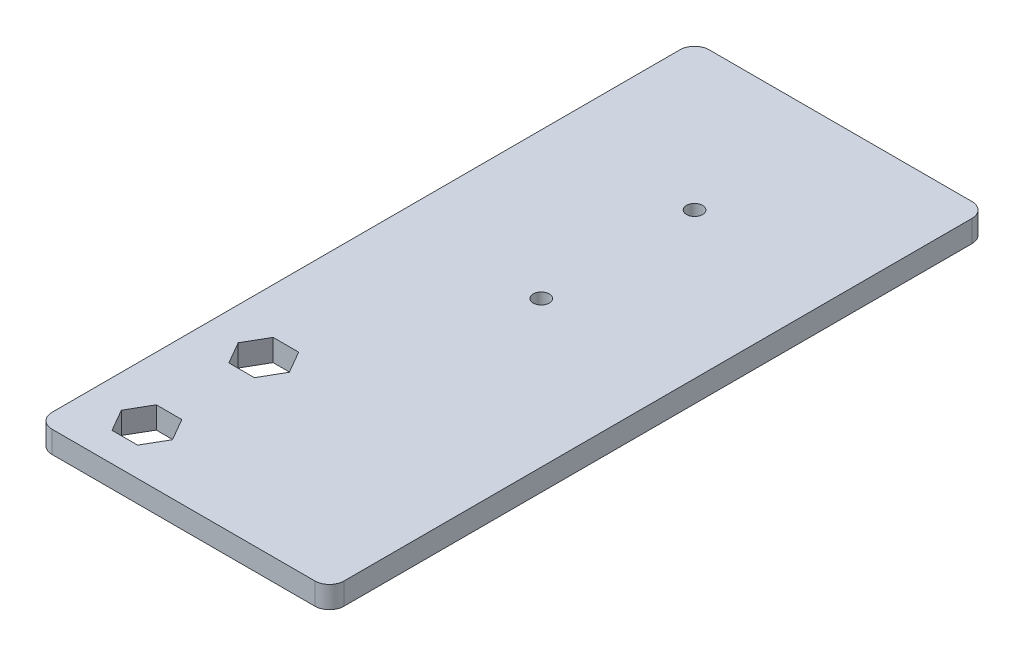
ISO-10303-21;
HEADER;
FILE_DESCRIPTION(('STEP AP214'),'2;1');
FILE_NAME('part.step','',(''),(''),'','','');
FILE_SCHEMA(('AUTOMOTIVE_DESIGN { 1 0 10303 214 1 1 1 1 }'));
ENDSEC;
DATA;
#1=APPLICATION_CONTEXT('core data for automotive mechanical design processes');
#2=APPLICATION_PROTOCOL_DEFINITION('international standard','automotive_design',2000,#1);
#3=PRODUCT_CONTEXT('',#1,'mechanical');
#4=PRODUCT('Part','Part','',(#3));
#5=PRODUCT_RELATED_PRODUCT_CATEGORY('part','',(#4));
#6=PRODUCT_DEFINITION_FORMATION('','',#4);
#7=PRODUCT_DEFINITION_CONTEXT('part definition',#1,'design');
#8=PRODUCT_DEFINITION('design','',#6,#7);
#9=PRODUCT_DEFINITION_SHAPE('','',#8);
#10=(LENGTH_UNIT() NAMED_UNIT(*) SI_UNIT(.MILLI.,.METRE.));
#11=(NAMED_UNIT(*) PLANE_ANGLE_UNIT() SI_UNIT($,.RADIAN.));
#12=(NAMED_UNIT(*) SI_UNIT($,.STERADIAN.) SOLID_ANGLE_UNIT());
#13=UNCERTAINTY_MEASURE_WITH_UNIT(LENGTH_MEASURE(1.E-05),#10,'distance_accuracy_value','');
#14=(GEOMETRIC_REPRESENTATION_CONTEXT(3) GLOBAL_UNCERTAINTY_ASSIGNED_CONTEXT((#13)) GLOBAL_UNIT_ASSIGNED_CONTEXT((#10,
#11,#12)) REPRESENTATION_CONTEXT('',''));
#15=CARTESIAN_POINT('',(0.,0.,0.));
#16=DIRECTION('',(0.,0.,1.));
#17=DIRECTION('',(1.,0.,0.));
#18=AXIS2_PLACEMENT_3D('',#15,#16,#17);
#19=CARTESIAN_POINT('',(51.,3.,-88.));
#20=DIRECTION('',(0.,-1.,0.));
#21=DIRECTION('',(0.,0.,-1.));
#22=AXIS2_PLACEMENT_3D('',#19,#20,#21);
#23=CYLINDRICAL_SURFACE('',#22,2.);
#24=CARTESIAN_POINT('',(51.,0.,-88.));
#25=DIRECTION('',(0.,1.,0.));
#26=DIRECTION('',(0.,0.,-1.));
#27=AXIS2_PLACEMENT_3D('',#24,#25,#26);
#28=CIRCLE('',#27,2.);
#29=CARTESIAN_POINT('',(53.,0.,-88.));
#30=VERTEX_POINT('',#29);
#31=CARTESIAN_POINT('',(51.,0.,-90.));
#32=VERTEX_POINT('',#31);
#33=EDGE_CURVE('E271',#30,#32,#28,.T.);
#34=ORIENTED_EDGE('',*,*,#33,.T.);
#35=DIRECTION('',(0.,-1.,0.));
#36=VECTOR('',#35,1.);
#37=CARTESIAN_POINT('',(51.,3.,-90.));
#38=LINE('',#37,#36);
#39=CARTESIAN_POINT('',(51.,3.,-90.));
#40=VERTEX_POINT('',#39);
#41=EDGE_CURVE('E11',#40,#32,#38,.T.);
#42=ORIENTED_EDGE('',*,*,#41,.F.);
#43=CARTESIAN_POINT('',(51.,3.,-88.));
#44=DIRECTION('',(0.,1.,0.));
#45=DIRECTION('',(0.,0.,-1.));
#46=AXIS2_PLACEMENT_3D('',#43,#44,#45);
#47=CIRCLE('',#46,2.);
#48=CARTESIAN_POINT('',(53.,3.,-88.));
#49=VERTEX_POINT('',#48);
#50=EDGE_CURVE('E281',#49,#40,#47,.T.);
#51=ORIENTED_EDGE('',*,*,#50,.F.);
#52=DIRECTION('',(0.,-1.,0.));
#53=VECTOR('',#52,1.);
#54=CARTESIAN_POINT('',(53.,3.,-88.));
#55=LINE('',#54,#53);
#56=EDGE_CURVE('E299',#49,#30,#55,.T.);
#57=ORIENTED_EDGE('',*,*,#56,.T.);
#58=EDGE_LOOP('',(#34,#42,#51,#57));
#59=FACE_BOUND('',#58,.T.);
#60=ADVANCED_FACE('F33',(#59),#23,.T.);
#61=CARTESIAN_POINT('',(15.,3.,-90.));
#62=DIRECTION('',(0.,0.,1.));
#63=DIRECTION('',(1.,0.,0.));
#64=AXIS2_PLACEMENT_3D('',#61,#62,#63);
#65=PLANE('',#64);
#66=DIRECTION('',(-1.,0.,0.));
#67=VECTOR('',#66,1.);
#68=CARTESIAN_POINT('',(15.,0.,-90.));
#69=LINE('',#68,#67);
#70=CARTESIAN_POINT('',(15.,0.,-90.));
#71=VERTEX_POINT('',#70);
#72=EDGE_CURVE('E302',#32,#71,#69,.T.);
#73=ORIENTED_EDGE('',*,*,#72,.T.);
#74=DIRECTION('',(0.,-1.,0.));
#75=VECTOR('',#74,1.);
#76=CARTESIAN_POINT('',(15.,3.,-90.));
#77=LINE('',#76,#75);
#78=CARTESIAN_POINT('',(15.,3.,-90.));
#79=VERTEX_POINT('',#78);
#80=EDGE_CURVE('E40',#79,#71,#77,.T.);
#81=ORIENTED_EDGE('',*,*,#80,.F.);
#82=DIRECTION('',(-1.,0.,0.));
#83=VECTOR('',#82,1.);
#84=CARTESIAN_POINT('',(15.,3.,-90.));
#85=LINE('',#84,#83);
#86=EDGE_CURVE('E284',#40,#79,#85,.T.);
#87=ORIENTED_EDGE('',*,*,#86,.F.);
#88=ORIENTED_EDGE('',*,*,#41,.T.);
#89=EDGE_LOOP('',(#73,#81,#87,#88));
#90=FACE_BOUND('',#89,.T.);
#91=ADVANCED_FACE('F358',(#90),#65,.F.);
#92=CARTESIAN_POINT('',(15.,3.,-88.));
#93=DIRECTION('',(0.,-1.,0.));
#94=DIRECTION('',(0.,0.,-1.));
#95=AXIS2_PLACEMENT_3D('',#92,#93,#94);
#96=CYLINDRICAL_SURFACE('',#95,2.);
#97=CARTESIAN_POINT('',(15.,0.,-88.));
#98=DIRECTION('',(0.,1.,0.));
#99=DIRECTION('',(0.,0.,1.));
#100=AXIS2_PLACEMENT_3D('',#97,#98,#99);
#101=CIRCLE('',#100,2.);
#102=CARTESIAN_POINT('',(13.,0.,-88.));
#103=VERTEX_POINT('',#102);
#104=EDGE_CURVE('E304',#71,#103,#101,.T.);
#105=ORIENTED_EDGE('',*,*,#104,.T.);
#106=DIRECTION('',(0.,-1.,0.));
#107=VECTOR('',#106,1.);
#108=CARTESIAN_POINT('',(13.,3.,-88.));
#109=LINE('',#108,#107);
#110=CARTESIAN_POINT('',(13.,3.,-88.));
#111=VERTEX_POINT('',#110);
#112=EDGE_CURVE('E329',#111,#103,#109,.T.);
#113=ORIENTED_EDGE('',*,*,#112,.F.);
#114=CARTESIAN_POINT('',(15.,3.,-88.));
#115=DIRECTION('',(0.,1.,0.));
#116=DIRECTION('',(0.,0.,1.));
#117=AXIS2_PLACEMENT_3D('',#114,#115,#116);
#118=CIRCLE('',#117,2.);
#119=EDGE_CURVE('E287',#79,#111,#118,.T.);
#120=ORIENTED_EDGE('',*,*,#119,.F.);
#121=ORIENTED_EDGE('',*,*,#80,.T.);
#122=EDGE_LOOP('',(#105,#113,#120,#121));
#123=FACE_BOUND('',#122,.T.);
#124=ADVANCED_FACE('F336',(#123),#96,.T.);
#125=CARTESIAN_POINT('',(13.,3.,-2.00000000000001));
#126=DIRECTION('',(1.,0.,0.));
#127=DIRECTION('',(0.,0.,-1.));
#128=AXIS2_PLACEMENT_3D('',#125,#126,#127);
#129=PLANE('',#128);
#130=DIRECTION('',(0.,0.,1.));
#131=VECTOR('',#130,1.);
#132=CARTESIAN_POINT('',(13.,0.,-2.00000000000001));
#133=LINE('',#132,#131);
#134=CARTESIAN_POINT('',(13.,0.,-2.00000000000001));
#135=VERTEX_POINT('',#134);
#136=EDGE_CURVE('E306',#103,#135,#133,.T.);
#137=ORIENTED_EDGE('',*,*,#136,.T.);
#138=DIRECTION('',(0.,-1.,0.));
#139=VECTOR('',#138,1.);
#140=CARTESIAN_POINT('',(13.,3.,-2.00000000000001));
#141=LINE('',#140,#139);
#142=CARTESIAN_POINT('',(13.,3.,-2.00000000000001));
#143=VERTEX_POINT('',#142);
#144=EDGE_CURVE('E326',#143,#135,#141,.T.);
#145=ORIENTED_EDGE('',*,*,#144,.F.);
#146=DIRECTION('',(0.,0.,1.));
#147=VECTOR('',#146,1.);
#148=CARTESIAN_POINT('',(13.,3.,-2.00000000000001));
#149=LINE('',#148,#147);
#150=EDGE_CURVE('E289',#111,#143,#149,.T.);
#151=ORIENTED_EDGE('',*,*,#150,.F.);
#152=ORIENTED_EDGE('',*,*,#112,.T.);
#153=EDGE_LOOP('',(#137,#145,#151,#152));
#154=FACE_BOUND('',#153,.T.);
#155=ADVANCED_FACE('F346',(#154),#129,.F.);
#156=CARTESIAN_POINT('',(15.,3.,-2.));
#157=DIRECTION('',(0.,-1.,0.));
#158=DIRECTION('',(0.,0.,-1.));
#159=AXIS2_PLACEMENT_3D('',#156,#157,#158);
#160=CYLINDRICAL_SURFACE('',#159,2.);
#161=CARTESIAN_POINT('',(15.,0.,-2.));
#162=DIRECTION('',(0.,1.,0.));
#163=DIRECTION('',(0.,0.,-1.));
#164=AXIS2_PLACEMENT_3D('',#161,#162,#163);
#165=CIRCLE('',#164,2.);
#166=CARTESIAN_POINT('',(15.,0.,0.));
#167=VERTEX_POINT('',#166);
#168=EDGE_CURVE('E308',#135,#167,#165,.T.);
#169=ORIENTED_EDGE('',*,*,#168,.T.);
#170=DIRECTION('',(0.,-1.,0.));
#171=VECTOR('',#170,1.);
#172=CARTESIAN_POINT('',(15.,3.,0.));
#173=LINE('',#172,#171);
#174=CARTESIAN_POINT('',(15.,3.,0.));
#175=VERTEX_POINT('',#174);
#176=EDGE_CURVE('E323',#175,#167,#173,.T.);
#177=ORIENTED_EDGE('',*,*,#176,.F.);
#178=CARTESIAN_POINT('',(15.,3.,-2.));
#179=DIRECTION('',(0.,1.,0.));
#180=DIRECTION('',(0.,0.,-1.));
#181=AXIS2_PLACEMENT_3D('',#178,#179,#180);
#182=CIRCLE('',#181,2.);
#183=EDGE_CURVE('E291',#143,#175,#182,.T.);
#184=ORIENTED_EDGE('',*,*,#183,.F.);
#185=ORIENTED_EDGE('',*,*,#144,.T.);
#186=EDGE_LOOP('',(#169,#177,#184,#185));
#187=FACE_BOUND('',#186,.T.);
#188=ADVANCED_FACE('F350',(#187),#160,.T.);
#189=CARTESIAN_POINT('',(15.,3.,0.));
#190=DIRECTION('',(0.,0.,-1.));
#191=DIRECTION('',(-1.,0.,0.));
#192=AXIS2_PLACEMENT_3D('',#189,#190,#191);
#193=PLANE('',#192);
#194=DIRECTION('',(1.,0.,0.));
#195=VECTOR('',#194,1.);
#196=CARTESIAN_POINT('',(15.,0.,0.));
#197=LINE('',#196,#195);
#198=CARTESIAN_POINT('',(51.,0.,0.));
#199=VERTEX_POINT('',#198);
#200=EDGE_CURVE('E310',#167,#199,#197,.T.);
#201=ORIENTED_EDGE('',*,*,#200,.T.);
#202=DIRECTION('',(0.,-1.,0.));
#203=VECTOR('',#202,1.);
#204=CARTESIAN_POINT('',(51.,3.,0.));
#205=LINE('',#204,#203);
#206=CARTESIAN_POINT('',(51.,3.,0.));
#207=VERTEX_POINT('',#206);
#208=EDGE_CURVE('E320',#207,#199,#205,.T.);
#209=ORIENTED_EDGE('',*,*,#208,.F.);
#210=DIRECTION('',(1.,0.,0.));
#211=VECTOR('',#210,1.);
#212=CARTESIAN_POINT('',(15.,3.,0.));
#213=LINE('',#212,#211);
#214=EDGE_CURVE('E293',#175,#207,#213,.T.);
#215=ORIENTED_EDGE('',*,*,#214,.F.);
#216=ORIENTED_EDGE('',*,*,#176,.T.);
#217=EDGE_LOOP('',(#201,#209,#215,#216));
#218=FACE_BOUND('',#217,.T.);
#219=ADVANCED_FACE('F371',(#218),#193,.F.);
#220=CARTESIAN_POINT('',(51.,3.,-2.));
#221=DIRECTION('',(0.,-1.,0.));
#222=DIRECTION('',(0.,0.,-1.));
#223=AXIS2_PLACEMENT_3D('',#220,#221,#222);
#224=CYLINDRICAL_SURFACE('',#223,2.);
#225=CARTESIAN_POINT('',(51.,0.,-2.));
#226=DIRECTION('',(0.,1.,0.));
#227=DIRECTION('',(0.,0.,1.));
#228=AXIS2_PLACEMENT_3D('',#225,#226,#227);
#229=CIRCLE('',#228,2.);
#230=CARTESIAN_POINT('',(53.,0.,-2.00000000000001));
#231=VERTEX_POINT('',#230);
#232=EDGE_CURVE('E312',#199,#231,#229,.T.);
#233=ORIENTED_EDGE('',*,*,#232,.T.);
#234=DIRECTION('',(0.,-1.,0.));
#235=VECTOR('',#234,1.);
#236=CARTESIAN_POINT('',(53.,3.,-2.00000000000001));
#237=LINE('',#236,#235);
#238=CARTESIAN_POINT('',(53.,3.,-2.00000000000001));
#239=VERTEX_POINT('',#238);
#240=EDGE_CURVE('E317',#239,#231,#237,.T.);
#241=ORIENTED_EDGE('',*,*,#240,.F.);
#242=CARTESIAN_POINT('',(51.,3.,-2.));
#243=DIRECTION('',(0.,1.,0.));
#244=DIRECTION('',(0.,0.,1.));
#245=AXIS2_PLACEMENT_3D('',#242,#243,#244);
#246=CIRCLE('',#245,2.);
#247=EDGE_CURVE('E295',#207,#239,#246,.T.);
#248=ORIENTED_EDGE('',*,*,#247,.F.);
#249=ORIENTED_EDGE('',*,*,#208,.T.);
#250=EDGE_LOOP('',(#233,#241,#248,#249));
#251=FACE_BOUND('',#250,.T.);
#252=ADVANCED_FACE('F369',(#251),#224,.T.);
#253=CARTESIAN_POINT('',(53.,3.,-88.));
#254=DIRECTION('',(-1.,0.,0.));
#255=DIRECTION('',(0.,0.,1.));
#256=AXIS2_PLACEMENT_3D('',#253,#254,#255);
#257=PLANE('',#256);
#258=DIRECTION('',(0.,0.,-1.));
#259=VECTOR('',#258,1.);
#260=CARTESIAN_POINT('',(53.,0.,-88.));
#261=LINE('',#260,#259);
#262=EDGE_CURVE('E285',#231,#30,#261,.T.);
#263=ORIENTED_EDGE('',*,*,#262,.T.);
#264=ORIENTED_EDGE('',*,*,#56,.F.);
#265=DIRECTION('',(0.,0.,-1.));
#266=VECTOR('',#265,1.);
#267=CARTESIAN_POINT('',(53.,3.,-88.));
#268=LINE('',#267,#266);
#269=EDGE_CURVE('E297',#239,#49,#268,.T.);
#270=ORIENTED_EDGE('',*,*,#269,.F.);
#271=ORIENTED_EDGE('',*,*,#240,.T.);
#272=EDGE_LOOP('',(#263,#264,#270,#271));
#273=FACE_BOUND('',#272,.T.);
#274=ADVANCED_FACE('F364',(#273),#257,.F.);
#275=CARTESIAN_POINT('',(51.,3.,-88.));
#276=DIRECTION('',(0.,-1.,0.));
#277=DIRECTION('',(0.,0.,-1.));
#278=AXIS2_PLACEMENT_3D('',#275,#276,#277);
#279=PLANE('',#278);
#280=DIRECTION('',(0.5,0.,0.866025403784439));
#281=VECTOR('',#280,1.);
#282=CARTESIAN_POINT('',(17.5,3.,-6.99999999999999));
#283=LINE('',#282,#281);
#284=CARTESIAN_POINT('',(17.5,3.,-6.99999999999999));
#285=VERTEX_POINT('',#284);
#286=CARTESIAN_POINT('',(19.25,3.,-3.96891108675446));
#287=VERTEX_POINT('',#286);
#288=EDGE_CURVE('E208',#285,#287,#283,.T.);
#289=ORIENTED_EDGE('',*,*,#288,.F.);
#290=DIRECTION('',(-0.5,0.,0.866025403784439));
#291=VECTOR('',#290,1.);
#292=CARTESIAN_POINT('',(19.25,3.,-10.0310889132455));
#293=LINE('',#292,#291);
#294=CARTESIAN_POINT('',(19.25,3.,-10.0310889132455));
#295=VERTEX_POINT('',#294);
#296=EDGE_CURVE('E47',#295,#285,#293,.T.);
#297=ORIENTED_EDGE('',*,*,#296,.F.);
#298=DIRECTION('',(-1.,0.,0.));
#299=VECTOR('',#298,1.);
#300=CARTESIAN_POINT('',(22.75,3.,-10.0310889132455));
#301=LINE('',#300,#299);
#302=CARTESIAN_POINT('',(22.75,3.,-10.0310889132455));
#303=VERTEX_POINT('',#302);
#304=EDGE_CURVE('E191',#303,#295,#301,.T.);
#305=ORIENTED_EDGE('',*,*,#304,.F.);
#306=DIRECTION('',(-0.5,0.,-0.866025403784438));
#307=VECTOR('',#306,1.);
#308=CARTESIAN_POINT('',(24.5,3.,-6.99999999999999));
#309=LINE('',#308,#307);
#310=CARTESIAN_POINT('',(24.5,3.,-6.99999999999999));
#311=VERTEX_POINT('',#310);
#312=EDGE_CURVE('E194',#311,#303,#309,.T.);
#313=ORIENTED_EDGE('',*,*,#312,.F.);
#314=DIRECTION('',(0.5,0.,-0.866025403784438));
#315=VECTOR('',#314,1.);
#316=CARTESIAN_POINT('',(22.75,3.,-3.96891108675446));
#317=LINE('',#316,#315);
#318=CARTESIAN_POINT('',(22.75,3.,-3.96891108675446));
#319=VERTEX_POINT('',#318);
#320=EDGE_CURVE('E214',#319,#311,#317,.T.);
#321=ORIENTED_EDGE('',*,*,#320,.F.);
#322=DIRECTION('',(1.,0.,0.));
#323=VECTOR('',#322,1.);
#324=CARTESIAN_POINT('',(19.25,3.,-3.96891108675446));
#325=LINE('',#324,#323);
#326=EDGE_CURVE('E211',#287,#319,#325,.T.);
#327=ORIENTED_EDGE('',*,*,#326,.F.);
#328=EDGE_LOOP('',(#289,#297,#305,#313,#321,#327));
#329=FACE_BOUND('',#328,.T.);
#330=CARTESIAN_POINT('',(33.,3.,-70.));
#331=DIRECTION('',(0.,1.,0.));
#332=DIRECTION('',(0.,0.,1.));
#333=AXIS2_PLACEMENT_3D('',#330,#331,#332);
#334=CIRCLE('',#333,1.1);
#335=CARTESIAN_POINT('',(33.,3.,-68.9));
#336=VERTEX_POINT('',#335);
#337=EDGE_CURVE('E230',#336,#336,#334,.T.);
#338=ORIENTED_EDGE('',*,*,#337,.F.);
#339=EDGE_LOOP('',(#338));
#340=FACE_BOUND('',#339,.T.);
#341=CARTESIAN_POINT('',(33.,3.,-49.));
#342=DIRECTION('',(0.,1.,0.));
#343=DIRECTION('',(0.,0.,1.));
#344=AXIS2_PLACEMENT_3D('',#341,#342,#343);
#345=CIRCLE('',#344,1.1);
#346=CARTESIAN_POINT('',(33.,3.,-47.9));
#347=VERTEX_POINT('',#346);
#348=EDGE_CURVE('E197',#347,#347,#345,.T.);
#349=ORIENTED_EDGE('',*,*,#348,.F.);
#350=EDGE_LOOP('',(#349));
#351=FACE_BOUND('',#350,.T.);
#352=DIRECTION('',(0.5,0.,0.866025403784439));
#353=VECTOR('',#352,1.);
#354=CARTESIAN_POINT('',(17.5,3.,-23.));
#355=LINE('',#354,#353);
#356=CARTESIAN_POINT('',(17.5,3.,-23.));
#357=VERTEX_POINT('',#356);
#358=CARTESIAN_POINT('',(19.25,3.,-19.9689110867545));
#359=VERTEX_POINT('',#358);
#360=EDGE_CURVE('E255',#357,#359,#355,.T.);
#361=ORIENTED_EDGE('',*,*,#360,.F.);
#362=DIRECTION('',(-0.500000000000001,0.,0.866025403784438));
#363=VECTOR('',#362,1.);
#364=CARTESIAN_POINT('',(19.25,3.,-26.0310889132455));
#365=LINE('',#364,#363);
#366=CARTESIAN_POINT('',(19.25,3.,-26.0310889132455));
#367=VERTEX_POINT('',#366);
#368=EDGE_CURVE('E55',#367,#357,#365,.T.);
#369=ORIENTED_EDGE('',*,*,#368,.F.);
#370=DIRECTION('',(-1.,0.,0.));
#371=VECTOR('',#370,1.);
#372=CARTESIAN_POINT('',(22.75,3.,-26.0310889132455));
#373=LINE('',#372,#371);
#374=CARTESIAN_POINT('',(22.75,3.,-26.0310889132455));
#375=VERTEX_POINT('',#374);
#376=EDGE_CURVE('E238',#375,#367,#373,.T.);
#377=ORIENTED_EDGE('',*,*,#376,.F.);
#378=DIRECTION('',(-0.500000000000001,0.,-0.866025403784438));
#379=VECTOR('',#378,1.);
#380=CARTESIAN_POINT('',(24.5,3.,-23.));
#381=LINE('',#380,#379);
#382=CARTESIAN_POINT('',(24.5,3.,-23.));
#383=VERTEX_POINT('',#382);
#384=EDGE_CURVE('E264',#383,#375,#381,.T.);
#385=ORIENTED_EDGE('',*,*,#384,.F.);
#386=DIRECTION('',(0.5,0.,-0.866025403784439));
#387=VECTOR('',#386,1.);
#388=CARTESIAN_POINT('',(22.75,3.,-19.9689110867545));
#389=LINE('',#388,#387);
#390=CARTESIAN_POINT('',(22.75,3.,-19.9689110867545));
#391=VERTEX_POINT('',#390);
#392=EDGE_CURVE('E261',#391,#383,#389,.T.);
#393=ORIENTED_EDGE('',*,*,#392,.F.);
#394=DIRECTION('',(1.,0.,0.));
#395=VECTOR('',#394,1.);
#396=CARTESIAN_POINT('',(19.25,3.,-19.9689110867545));
#397=LINE('',#396,#395);
#398=EDGE_CURVE('E258',#359,#391,#397,.T.);
#399=ORIENTED_EDGE('',*,*,#398,.F.);
#400=EDGE_LOOP('',(#361,#369,#377,#385,#393,#399));
#401=FACE_BOUND('',#400,.T.);
#402=ORIENTED_EDGE('',*,*,#50,.T.);
#403=ORIENTED_EDGE('',*,*,#86,.T.);
#404=ORIENTED_EDGE('',*,*,#119,.T.);
#405=ORIENTED_EDGE('',*,*,#150,.T.);
#406=ORIENTED_EDGE('',*,*,#183,.T.);
#407=ORIENTED_EDGE('',*,*,#214,.T.);
#408=ORIENTED_EDGE('',*,*,#247,.T.);
#409=ORIENTED_EDGE('',*,*,#269,.T.);
#410=EDGE_LOOP('',(#402,#403,#404,#405,#406,#407,#408,#409));
#411=FACE_BOUND('',#410,.T.);
#412=ADVANCED_FACE('F354',(#329,#340,#351,#401,#411),#279,.F.);
#413=CARTESIAN_POINT('',(51.,0.,-88.));
#414=DIRECTION('',(0.,-1.,0.));
#415=DIRECTION('',(0.,0.,-1.));
#416=AXIS2_PLACEMENT_3D('',#413,#414,#415);
#417=PLANE('',#416);
#418=DIRECTION('',(-0.5,0.,0.866025403784439));
#419=VECTOR('',#418,1.);
#420=CARTESIAN_POINT('',(19.25,0.,-10.0310889132455));
#421=LINE('',#420,#419);
#422=CARTESIAN_POINT('',(19.25,0.,-10.0310889132455));
#423=VERTEX_POINT('',#422);
#424=CARTESIAN_POINT('',(17.5,0.,-6.99999999999999));
#425=VERTEX_POINT('',#424);
#426=EDGE_CURVE('E171',#423,#425,#421,.T.);
#427=ORIENTED_EDGE('',*,*,#426,.T.);
#428=DIRECTION('',(0.5,0.,0.866025403784439));
#429=VECTOR('',#428,1.);
#430=CARTESIAN_POINT('',(17.5,0.,-6.99999999999999));
#431=LINE('',#430,#429);
#432=CARTESIAN_POINT('',(19.25,0.,-3.96891108675446));
#433=VERTEX_POINT('',#432);
#434=EDGE_CURVE('E181',#425,#433,#431,.T.);
#435=ORIENTED_EDGE('',*,*,#434,.T.);
#436=DIRECTION('',(1.,0.,0.));
#437=VECTOR('',#436,1.);
#438=CARTESIAN_POINT('',(19.25,0.,-3.96891108675446));
#439=LINE('',#438,#437);
#440=CARTESIAN_POINT('',(22.75,0.,-3.96891108675446));
#441=VERTEX_POINT('',#440);
#442=EDGE_CURVE('E185',#433,#441,#439,.T.);
#443=ORIENTED_EDGE('',*,*,#442,.T.);
#444=DIRECTION('',(0.5,0.,-0.866025403784438));
#445=VECTOR('',#444,1.);
#446=CARTESIAN_POINT('',(22.75,0.,-3.96891108675446));
#447=LINE('',#446,#445);
#448=CARTESIAN_POINT('',(24.5,0.,-6.99999999999999));
#449=VERTEX_POINT('',#448);
#450=EDGE_CURVE('E201',#441,#449,#447,.T.);
#451=ORIENTED_EDGE('',*,*,#450,.T.);
#452=DIRECTION('',(-0.5,0.,-0.866025403784438));
#453=VECTOR('',#452,1.);
#454=CARTESIAN_POINT('',(24.5,0.,-6.99999999999999));
#455=LINE('',#454,#453);
#456=CARTESIAN_POINT('',(22.75,0.,-10.0310889132455));
#457=VERTEX_POINT('',#456);
#458=EDGE_CURVE('E204',#449,#457,#455,.T.);
#459=ORIENTED_EDGE('',*,*,#458,.T.);
#460=DIRECTION('',(-1.,0.,0.));
#461=VECTOR('',#460,1.);
#462=CARTESIAN_POINT('',(22.75,0.,-10.0310889132455));
#463=LINE('',#462,#461);
#464=EDGE_CURVE('E177',#457,#423,#463,.T.);
#465=ORIENTED_EDGE('',*,*,#464,.T.);
#466=EDGE_LOOP('',(#427,#435,#443,#451,#459,#465));
#467=FACE_BOUND('',#466,.T.);
#468=CARTESIAN_POINT('',(33.,0.,-70.));
#469=DIRECTION('',(0.,1.,0.));
#470=DIRECTION('',(0.,0.,1.));
#471=AXIS2_PLACEMENT_3D('',#468,#469,#470);
#472=CIRCLE('',#471,1.1);
#473=CARTESIAN_POINT('',(33.,0.,-68.9));
#474=VERTEX_POINT('',#473);
#475=EDGE_CURVE('E209',#474,#474,#472,.T.);
#476=ORIENTED_EDGE('',*,*,#475,.T.);
#477=EDGE_LOOP('',(#476));
#478=FACE_BOUND('',#477,.T.);
#479=CARTESIAN_POINT('',(33.,0.,-49.));
#480=DIRECTION('',(0.,1.,0.));
#481=DIRECTION('',(0.,0.,1.));
#482=AXIS2_PLACEMENT_3D('',#479,#480,#481);
#483=CIRCLE('',#482,1.1);
#484=CARTESIAN_POINT('',(33.,0.,-47.9));
#485=VERTEX_POINT('',#484);
#486=EDGE_CURVE('E233',#485,#485,#483,.T.);
#487=ORIENTED_EDGE('',*,*,#486,.T.);
#488=EDGE_LOOP('',(#487));
#489=FACE_BOUND('',#488,.T.);
#490=DIRECTION('',(-0.500000000000001,0.,0.866025403784438));
#491=VECTOR('',#490,1.);
#492=CARTESIAN_POINT('',(19.25,0.,-26.0310889132455));
#493=LINE('',#492,#491);
#494=CARTESIAN_POINT('',(19.25,0.,-26.0310889132455));
#495=VERTEX_POINT('',#494);
#496=CARTESIAN_POINT('',(17.5,0.,-23.));
#497=VERTEX_POINT('',#496);
#498=EDGE_CURVE('E234',#495,#497,#493,.T.);
#499=ORIENTED_EDGE('',*,*,#498,.T.);
#500=DIRECTION('',(0.5,0.,0.866025403784439));
#501=VECTOR('',#500,1.);
#502=CARTESIAN_POINT('',(17.5,0.,-23.));
#503=LINE('',#502,#501);
#504=CARTESIAN_POINT('',(19.25,0.,-19.9689110867544));
#505=VERTEX_POINT('',#504);
#506=EDGE_CURVE('E237',#497,#505,#503,.T.);
#507=ORIENTED_EDGE('',*,*,#506,.T.);
#508=DIRECTION('',(1.,0.,0.));
#509=VECTOR('',#508,1.);
#510=CARTESIAN_POINT('',(19.25,0.,-19.9689110867545));
#511=LINE('',#510,#509);
#512=CARTESIAN_POINT('',(22.75,0.,-19.9689110867545));
#513=VERTEX_POINT('',#512);
#514=EDGE_CURVE('E241',#505,#513,#511,.T.);
#515=ORIENTED_EDGE('',*,*,#514,.T.);
#516=DIRECTION('',(0.5,0.,-0.866025403784439));
#517=VECTOR('',#516,1.);
#518=CARTESIAN_POINT('',(22.75,0.,-19.9689110867545));
#519=LINE('',#518,#517);
#520=CARTESIAN_POINT('',(24.5,0.,-23.));
#521=VERTEX_POINT('',#520);
#522=EDGE_CURVE('E244',#513,#521,#519,.T.);
#523=ORIENTED_EDGE('',*,*,#522,.T.);
#524=DIRECTION('',(-0.500000000000001,0.,-0.866025403784438));
#525=VECTOR('',#524,1.);
#526=CARTESIAN_POINT('',(24.5,0.,-23.));
#527=LINE('',#526,#525);
#528=CARTESIAN_POINT('',(22.75,0.,-26.0310889132455));
#529=VERTEX_POINT('',#528);
#530=EDGE_CURVE('E247',#521,#529,#527,.T.);
#531=ORIENTED_EDGE('',*,*,#530,.T.);
#532=DIRECTION('',(-1.,0.,0.));
#533=VECTOR('',#532,1.);
#534=CARTESIAN_POINT('',(22.75,0.,-26.0310889132455));
#535=LINE('',#534,#533);
#536=EDGE_CURVE('E250',#529,#495,#535,.T.);
#537=ORIENTED_EDGE('',*,*,#536,.T.);
#538=EDGE_LOOP('',(#499,#507,#515,#523,#531,#537));
#539=FACE_BOUND('',#538,.T.);
#540=ORIENTED_EDGE('',*,*,#33,.F.);
#541=ORIENTED_EDGE('',*,*,#262,.F.);
#542=ORIENTED_EDGE('',*,*,#232,.F.);
#543=ORIENTED_EDGE('',*,*,#200,.F.);
#544=ORIENTED_EDGE('',*,*,#168,.F.);
#545=ORIENTED_EDGE('',*,*,#136,.F.);
#546=ORIENTED_EDGE('',*,*,#104,.F.);
#547=ORIENTED_EDGE('',*,*,#72,.F.);
#548=EDGE_LOOP('',(#540,#541,#542,#543,#544,#545,#546,#547));
#549=FACE_BOUND('',#548,.T.);
#550=ADVANCED_FACE('F187',(#467,#478,#489,#539,#549),#417,.T.);
#551=CARTESIAN_POINT('',(19.25,0.,-26.0310889132455));
#552=DIRECTION('',(-0.866025403784438,0.,-0.500000000000001));
#553=DIRECTION('',(-0.500000000000001,0.,0.866025403784438));
#554=AXIS2_PLACEMENT_3D('',#551,#552,#553);
#555=PLANE('',#554);
#556=ORIENTED_EDGE('',*,*,#368,.T.);
#557=DIRECTION('',(0.,1.,0.));
#558=VECTOR('',#557,1.);
#559=CARTESIAN_POINT('',(17.5,0.,-23.));
#560=LINE('',#559,#558);
#561=EDGE_CURVE('E253',#497,#357,#560,.T.);
#562=ORIENTED_EDGE('',*,*,#561,.F.);
#563=ORIENTED_EDGE('',*,*,#498,.F.);
#564=DIRECTION('',(0.,1.,0.));
#565=VECTOR('',#564,1.);
#566=CARTESIAN_POINT('',(19.25,0.,-26.0310889132455));
#567=LINE('',#566,#565);
#568=EDGE_CURVE('E269',#495,#367,#567,.T.);
#569=ORIENTED_EDGE('',*,*,#568,.T.);
#570=EDGE_LOOP('',(#556,#562,#563,#569));
#571=FACE_BOUND('',#570,.T.);
#572=ADVANCED_FACE('F431',(#571),#555,.F.);
#573=CARTESIAN_POINT('',(22.75,0.,-26.0310889132455));
#574=DIRECTION('',(0.,0.,-1.));
#575=DIRECTION('',(-1.,0.,0.));
#576=AXIS2_PLACEMENT_3D('',#573,#574,#575);
#577=PLANE('',#576);
#578=ORIENTED_EDGE('',*,*,#376,.T.);
#579=ORIENTED_EDGE('',*,*,#568,.F.);
#580=ORIENTED_EDGE('',*,*,#536,.F.);
#581=DIRECTION('',(0.,1.,0.));
#582=VECTOR('',#581,1.);
#583=CARTESIAN_POINT('',(22.75,0.,-26.0310889132455));
#584=LINE('',#583,#582);
#585=EDGE_CURVE('E272',#529,#375,#584,.T.);
#586=ORIENTED_EDGE('',*,*,#585,.T.);
#587=EDGE_LOOP('',(#578,#579,#580,#586));
#588=FACE_BOUND('',#587,.T.);
#589=ADVANCED_FACE('F439',(#588),#577,.F.);
#590=CARTESIAN_POINT('',(24.5,0.,-23.));
#591=DIRECTION('',(0.866025403784438,0.,-0.500000000000001));
#592=DIRECTION('',(-0.500000000000001,0.,-0.866025403784438));
#593=AXIS2_PLACEMENT_3D('',#590,#591,#592);
#594=PLANE('',#593);
#595=ORIENTED_EDGE('',*,*,#384,.T.);
#596=ORIENTED_EDGE('',*,*,#585,.F.);
#597=ORIENTED_EDGE('',*,*,#530,.F.);
#598=DIRECTION('',(0.,1.,0.));
#599=VECTOR('',#598,1.);
#600=CARTESIAN_POINT('',(24.5,0.,-23.));
#601=LINE('',#600,#599);
#602=EDGE_CURVE('E274',#521,#383,#601,.T.);
#603=ORIENTED_EDGE('',*,*,#602,.T.);
#604=EDGE_LOOP('',(#595,#596,#597,#603));
#605=FACE_BOUND('',#604,.T.);
#606=ADVANCED_FACE('F448',(#605),#594,.F.);
#607=CARTESIAN_POINT('',(22.75,0.,-19.9689110867545));
#608=DIRECTION('',(0.866025403784439,0.,0.5));
#609=DIRECTION('',(0.5,0.,-0.866025403784439));
#610=AXIS2_PLACEMENT_3D('',#607,#608,#609);
#611=PLANE('',#610);
#612=ORIENTED_EDGE('',*,*,#392,.T.);
#613=ORIENTED_EDGE('',*,*,#602,.F.);
#614=ORIENTED_EDGE('',*,*,#522,.F.);
#615=DIRECTION('',(0.,1.,0.));
#616=VECTOR('',#615,1.);
#617=CARTESIAN_POINT('',(22.75,0.,-19.9689110867545));
#618=LINE('',#617,#616);
#619=EDGE_CURVE('E276',#513,#391,#618,.T.);
#620=ORIENTED_EDGE('',*,*,#619,.T.);
#621=EDGE_LOOP('',(#612,#613,#614,#620));
#622=FACE_BOUND('',#621,.T.);
#623=ADVANCED_FACE('F458',(#622),#611,.F.);
#624=CARTESIAN_POINT('',(19.25,0.,-19.9689110867545));
#625=DIRECTION('',(0.,0.,1.));
#626=DIRECTION('',(1.,0.,0.));
#627=AXIS2_PLACEMENT_3D('',#624,#625,#626);
#628=PLANE('',#627);
#629=ORIENTED_EDGE('',*,*,#398,.T.);
#630=ORIENTED_EDGE('',*,*,#619,.F.);
#631=ORIENTED_EDGE('',*,*,#514,.F.);
#632=DIRECTION('',(0.,1.,0.));
#633=VECTOR('',#632,1.);
#634=CARTESIAN_POINT('',(19.25,0.,-19.9689110867545));
#635=LINE('',#634,#633);
#636=EDGE_CURVE('E278',#505,#359,#635,.T.);
#637=ORIENTED_EDGE('',*,*,#636,.T.);
#638=EDGE_LOOP('',(#629,#630,#631,#637));
#639=FACE_BOUND('',#638,.T.);
#640=ADVANCED_FACE('F468',(#639),#628,.F.);
#641=CARTESIAN_POINT('',(17.5,0.,-23.));
#642=DIRECTION('',(-0.866025403784439,0.,0.5));
#643=DIRECTION('',(0.5,0.,0.866025403784439));
#644=AXIS2_PLACEMENT_3D('',#641,#642,#643);
#645=PLANE('',#644);
#646=ORIENTED_EDGE('',*,*,#360,.T.);
#647=ORIENTED_EDGE('',*,*,#636,.F.);
#648=ORIENTED_EDGE('',*,*,#506,.F.);
#649=ORIENTED_EDGE('',*,*,#561,.T.);
#650=EDGE_LOOP('',(#646,#647,#648,#649));
#651=FACE_BOUND('',#650,.T.);
#652=ADVANCED_FACE('F478',(#651),#645,.F.);
#653=CARTESIAN_POINT('',(33.,0.,-49.));
#654=DIRECTION('',(0.,1.,0.));
#655=DIRECTION('',(0.,0.,1.));
#656=AXIS2_PLACEMENT_3D('',#653,#654,#655);
#657=CYLINDRICAL_SURFACE('',#656,1.1);
#658=ORIENTED_EDGE('',*,*,#486,.F.);
#659=EDGE_LOOP('',(#658));
#660=FACE_BOUND('',#659,.T.);
#661=ORIENTED_EDGE('',*,*,#348,.T.);
#662=EDGE_LOOP('',(#661));
#663=FACE_BOUND('',#662,.T.);
#664=ADVANCED_FACE('F488',(#660,#663),#657,.F.);
#665=CARTESIAN_POINT('',(33.,0.,-70.));
#666=DIRECTION('',(0.,1.,0.));
#667=DIRECTION('',(0.,0.,1.));
#668=AXIS2_PLACEMENT_3D('',#665,#666,#667);
#669=CYLINDRICAL_SURFACE('',#668,1.1);
#670=ORIENTED_EDGE('',*,*,#475,.F.);
#671=EDGE_LOOP('',(#670));
#672=FACE_BOUND('',#671,.T.);
#673=ORIENTED_EDGE('',*,*,#337,.T.);
#674=EDGE_LOOP('',(#673));
#675=FACE_BOUND('',#674,.T.);
#676=ADVANCED_FACE('F498',(#672,#675),#669,.F.);
#677=CARTESIAN_POINT('',(19.25,0.,-10.0310889132455));
#678=DIRECTION('',(-0.866025403784438,0.,-0.5));
#679=DIRECTION('',(-0.5,0.,0.866025403784439));
#680=AXIS2_PLACEMENT_3D('',#677,#678,#679);
#681=PLANE('',#680);
#682=ORIENTED_EDGE('',*,*,#296,.T.);
#683=DIRECTION('',(0.,1.,0.));
#684=VECTOR('',#683,1.);
#685=CARTESIAN_POINT('',(17.5,0.,-6.99999999999999));
#686=LINE('',#685,#684);
#687=EDGE_CURVE('E167',#425,#285,#686,.T.);
#688=ORIENTED_EDGE('',*,*,#687,.F.);
#689=ORIENTED_EDGE('',*,*,#426,.F.);
#690=DIRECTION('',(0.,1.,0.));
#691=VECTOR('',#690,1.);
#692=CARTESIAN_POINT('',(19.25,0.,-10.0310889132455));
#693=LINE('',#692,#691);
#694=EDGE_CURVE('E219',#423,#295,#693,.T.);
#695=ORIENTED_EDGE('',*,*,#694,.T.);
#696=EDGE_LOOP('',(#682,#688,#689,#695));
#697=FACE_BOUND('',#696,.T.);
#698=ADVANCED_FACE('F169',(#697),#681,.F.);
#699=CARTESIAN_POINT('',(22.75,0.,-10.0310889132455));
#700=DIRECTION('',(0.,0.,-1.));
#701=DIRECTION('',(-1.,0.,0.));
#702=AXIS2_PLACEMENT_3D('',#699,#700,#701);
#703=PLANE('',#702);
#704=ORIENTED_EDGE('',*,*,#304,.T.);
#705=ORIENTED_EDGE('',*,*,#694,.F.);
#706=ORIENTED_EDGE('',*,*,#464,.F.);
#707=DIRECTION('',(0.,1.,0.));
#708=VECTOR('',#707,1.);
#709=CARTESIAN_POINT('',(22.75,0.,-10.0310889132455));
#710=LINE('',#709,#708);
#711=EDGE_CURVE('E221',#457,#303,#710,.T.);
#712=ORIENTED_EDGE('',*,*,#711,.T.);
#713=EDGE_LOOP('',(#704,#705,#706,#712));
#714=FACE_BOUND('',#713,.T.);
#715=ADVANCED_FACE('F517',(#714),#703,.F.);
#716=CARTESIAN_POINT('',(24.5,0.,-6.99999999999999));
#717=DIRECTION('',(0.866025403784438,0.,-0.500000000000001));
#718=DIRECTION('',(-0.500000000000001,0.,-0.866025403784438));
#719=AXIS2_PLACEMENT_3D('',#716,#717,#718);
#720=PLANE('',#719);
#721=ORIENTED_EDGE('',*,*,#312,.T.);
#722=ORIENTED_EDGE('',*,*,#711,.F.);
#723=ORIENTED_EDGE('',*,*,#458,.F.);
#724=DIRECTION('',(0.,1.,0.));
#725=VECTOR('',#724,1.);
#726=CARTESIAN_POINT('',(24.5,0.,-6.99999999999999));
#727=LINE('',#726,#725);
#728=EDGE_CURVE('E223',#449,#311,#727,.T.);
#729=ORIENTED_EDGE('',*,*,#728,.T.);
#730=EDGE_LOOP('',(#721,#722,#723,#729));
#731=FACE_BOUND('',#730,.T.);
#732=ADVANCED_FACE('F526',(#731),#720,.F.);
#733=CARTESIAN_POINT('',(22.75,0.,-3.96891108675446));
#734=DIRECTION('',(0.866025403784438,0.,0.500000000000001));
#735=DIRECTION('',(0.500000000000001,0.,-0.866025403784438));
#736=AXIS2_PLACEMENT_3D('',#733,#734,#735);
#737=PLANE('',#736);
#738=ORIENTED_EDGE('',*,*,#320,.T.);
#739=ORIENTED_EDGE('',*,*,#728,.F.);
#740=ORIENTED_EDGE('',*,*,#450,.F.);
#741=DIRECTION('',(0.,1.,0.));
#742=VECTOR('',#741,1.);
#743=CARTESIAN_POINT('',(22.75,0.,-3.96891108675446));
#744=LINE('',#743,#742);
#745=EDGE_CURVE('E225',#441,#319,#744,.T.);
#746=ORIENTED_EDGE('',*,*,#745,.T.);
#747=EDGE_LOOP('',(#738,#739,#740,#746));
#748=FACE_BOUND('',#747,.T.);
#749=ADVANCED_FACE('F536',(#748),#737,.F.);
#750=CARTESIAN_POINT('',(19.25,0.,-3.96891108675446));
#751=DIRECTION('',(0.,0.,1.));
#752=DIRECTION('',(1.,0.,0.));
#753=AXIS2_PLACEMENT_3D('',#750,#751,#752);
#754=PLANE('',#753);
#755=ORIENTED_EDGE('',*,*,#326,.T.);
#756=ORIENTED_EDGE('',*,*,#745,.F.);
#757=ORIENTED_EDGE('',*,*,#442,.F.);
#758=DIRECTION('',(0.,1.,0.));
#759=VECTOR('',#758,1.);
#760=CARTESIAN_POINT('',(19.25,0.,-3.96891108675446));
#761=LINE('',#760,#759);
#762=EDGE_CURVE('E176',#433,#287,#761,.T.);
#763=ORIENTED_EDGE('',*,*,#762,.T.);
#764=EDGE_LOOP('',(#755,#756,#757,#763));
#765=FACE_BOUND('',#764,.T.);
#766=ADVANCED_FACE('F546',(#765),#754,.F.);
#767=CARTESIAN_POINT('',(17.5,0.,-6.99999999999999));
#768=DIRECTION('',(-0.866025403784438,0.,0.5));
#769=DIRECTION('',(0.5,0.,0.866025403784439));
#770=AXIS2_PLACEMENT_3D('',#767,#768,#769);
#771=PLANE('',#770);
#772=ORIENTED_EDGE('',*,*,#288,.T.);
#773=ORIENTED_EDGE('',*,*,#762,.F.);
#774=ORIENTED_EDGE('',*,*,#434,.F.);
#775=ORIENTED_EDGE('',*,*,#687,.T.);
#776=EDGE_LOOP('',(#772,#773,#774,#775));
#777=FACE_BOUND('',#776,.T.);
#778=ADVANCED_FACE('F182',(#777),#771,.F.);
#779=CLOSED_SHELL('',(#60,#91,#124,#155,#188,#219,#252,#274,#412,#550,#572,#589,#606,#623,#640,
#652,#664,#676,#698,#715,#732,#749,#766,#778));
#780=MANIFOLD_SOLID_BREP('B2',#779);
#781=ADVANCED_BREP_SHAPE_REPRESENTATION('',(#18,#780),#14);
#782=SHAPE_DEFINITION_REPRESENTATION(#9,#781);
ENDSEC;
END-ISO-10303-21;
